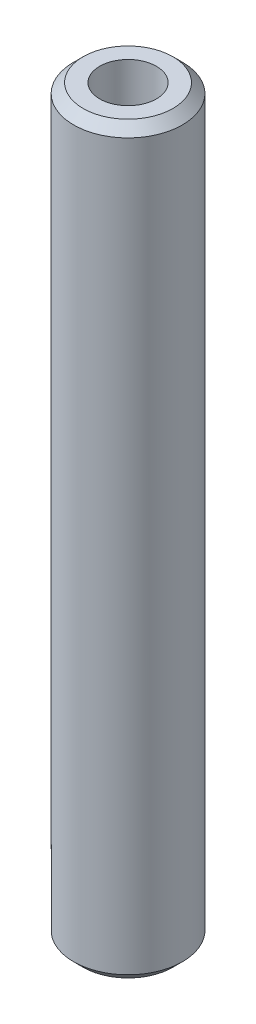
ISO-10303-21;
HEADER;
FILE_DESCRIPTION(('STEP AP214'),'2;1');
FILE_NAME('part.step','',(''),(''),'','','');
FILE_SCHEMA(('AUTOMOTIVE_DESIGN { 1 0 10303 214 1 1 1 1 }'));
ENDSEC;
DATA;
#1=APPLICATION_CONTEXT('core data for automotive mechanical design processes');
#2=APPLICATION_PROTOCOL_DEFINITION('international standard','automotive_design',2000,#1);
#3=PRODUCT_CONTEXT('',#1,'mechanical');
#4=PRODUCT('Part','Part','',(#3));
#5=PRODUCT_RELATED_PRODUCT_CATEGORY('part','',(#4));
#6=PRODUCT_DEFINITION_FORMATION('','',#4);
#7=PRODUCT_DEFINITION_CONTEXT('part definition',#1,'design');
#8=PRODUCT_DEFINITION('design','',#6,#7);
#9=PRODUCT_DEFINITION_SHAPE('','',#8);
#10=(LENGTH_UNIT() NAMED_UNIT(*) SI_UNIT(.MILLI.,.METRE.));
#11=(NAMED_UNIT(*) PLANE_ANGLE_UNIT() SI_UNIT($,.RADIAN.));
#12=(NAMED_UNIT(*) SI_UNIT($,.STERADIAN.) SOLID_ANGLE_UNIT());
#13=UNCERTAINTY_MEASURE_WITH_UNIT(LENGTH_MEASURE(1.E-05),#10,'distance_accuracy_value','');
#14=(GEOMETRIC_REPRESENTATION_CONTEXT(3) GLOBAL_UNCERTAINTY_ASSIGNED_CONTEXT((#13)) GLOBAL_UNIT_ASSIGNED_CONTEXT((#10,
#11,#12)) REPRESENTATION_CONTEXT('',''));
#15=CARTESIAN_POINT('',(0.,0.,0.));
#16=DIRECTION('',(0.,0.,1.));
#17=DIRECTION('',(1.,0.,0.));
#18=AXIS2_PLACEMENT_3D('',#15,#16,#17);
#19=CARTESIAN_POINT('',(0.,205.13082230466,0.));
#20=DIRECTION('',(0.,-1.,0.));
#21=DIRECTION('',(0.,0.,-1.));
#22=AXIS2_PLACEMENT_3D('',#19,#20,#21);
#23=CYLINDRICAL_SURFACE('',#22,15.);
#24=CARTESIAN_POINT('',(0.,202.50995726954,0.));
#25=DIRECTION('',(0.,1.,0.));
#26=DIRECTION('',(0.,0.,1.));
#27=AXIS2_PLACEMENT_3D('',#24,#25,#26);
#28=CIRCLE('',#27,15.);
#29=CARTESIAN_POINT('',(0.,202.50995726954,-15.));
#30=VERTEX_POINT('',#29);
#31=EDGE_CURVE('E50',#30,#30,#28,.F.);
#32=CARTESIAN_POINT('',(0.,2.62086503512082,0.));
#33=DIRECTION('',(0.,1.,0.));
#34=DIRECTION('',(0.,0.,1.));
#35=AXIS2_PLACEMENT_3D('',#32,#33,#34);
#36=CIRCLE('',#35,15.);
#37=CARTESIAN_POINT('',(0.,2.6208650351208,-15.));
#38=VERTEX_POINT('',#37);
#39=EDGE_CURVE('E51',#38,#38,#36,.T.);
#40=CARTESIAN_POINT('',(0.,202.50995726954,-15.));
#41=CARTESIAN_POINT('',(0.,200.427779225431,-15.));
#42=CARTESIAN_POINT('',(0.,198.345601181323,-15.));
#43=CARTESIAN_POINT('',(0.,194.181245093106,-15.));
#44=CARTESIAN_POINT('',(0.,192.099067048997,-15.));
#45=CARTESIAN_POINT('',(0.,187.93471096078,-15.));
#46=CARTESIAN_POINT('',(0.,185.852532916672,-15.));
#47=CARTESIAN_POINT('',(0.,181.688176828454,-15.));
#48=CARTESIAN_POINT('',(0.,179.605998784346,-15.));
#49=CARTESIAN_POINT('',(0.,175.441642696129,-15.));
#50=CARTESIAN_POINT('',(0.,173.35946465202,-15.));
#51=CARTESIAN_POINT('',(0.,169.195108563803,-15.));
#52=CARTESIAN_POINT('',(0.,167.112930519695,-15.));
#53=CARTESIAN_POINT('',(0.,162.948574431478,-15.));
#54=CARTESIAN_POINT('',(0.,160.866396387369,-15.));
#55=CARTESIAN_POINT('',(0.,156.702040299152,-15.));
#56=CARTESIAN_POINT('',(0.,154.619862255044,-15.));
#57=CARTESIAN_POINT('',(0.,150.455506166826,-15.));
#58=CARTESIAN_POINT('',(0.,148.373328122718,-15.));
#59=CARTESIAN_POINT('',(0.,144.208972034501,-15.));
#60=CARTESIAN_POINT('',(0.,142.126793990392,-15.));
#61=CARTESIAN_POINT('',(0.,137.962437902175,-15.));
#62=CARTESIAN_POINT('',(0.,135.880259858067,-15.));
#63=CARTESIAN_POINT('',(0.,131.71590376985,-15.));
#64=CARTESIAN_POINT('',(0.,129.633725725741,-15.));
#65=CARTESIAN_POINT('',(0.,125.469369637524,-15.));
#66=CARTESIAN_POINT('',(0.,123.387191593416,-15.));
#67=CARTESIAN_POINT('',(0.,119.222835505199,-15.));
#68=CARTESIAN_POINT('',(0.,117.14065746109,-15.));
#69=CARTESIAN_POINT('',(0.,112.976301372873,-15.));
#70=CARTESIAN_POINT('',(0.,110.894123328764,-15.));
#71=CARTESIAN_POINT('',(0.,106.729767240547,-15.));
#72=CARTESIAN_POINT('',(0.,104.647589196439,-15.));
#73=CARTESIAN_POINT('',(0.,100.483233108222,-15.));
#74=CARTESIAN_POINT('',(0.,98.4010550641132,-15.));
#75=CARTESIAN_POINT('',(0.,94.2366989758962,-15.));
#76=CARTESIAN_POINT('',(0.,92.1545209317876,-15.));
#77=CARTESIAN_POINT('',(0.,87.9901648435706,-15.));
#78=CARTESIAN_POINT('',(0.,85.907986799462,-15.));
#79=CARTESIAN_POINT('',(0.,81.743630711245,-15.));
#80=CARTESIAN_POINT('',(0.,79.6614526671364,-15.));
#81=CARTESIAN_POINT('',(0.,75.4970965789194,-15.));
#82=CARTESIAN_POINT('',(0.,73.4149185348109,-15.));
#83=CARTESIAN_POINT('',(0.,69.2505624465938,-15.));
#84=CARTESIAN_POINT('',(0.,67.1683844024853,-15.));
#85=CARTESIAN_POINT('',(0.,63.0040283142682,-15.));
#86=CARTESIAN_POINT('',(0.,60.9218502701597,-15.));
#87=CARTESIAN_POINT('',(0.,56.7574941819426,-15.));
#88=CARTESIAN_POINT('',(0.,54.6753161378341,-15.));
#89=CARTESIAN_POINT('',(0.,50.510960049617,-15.));
#90=CARTESIAN_POINT('',(0.,48.4287820055085,-15.));
#91=CARTESIAN_POINT('',(0.,44.2644259172914,-15.));
#92=CARTESIAN_POINT('',(0.,42.1822478731829,-15.));
#93=CARTESIAN_POINT('',(0.,38.0178917849658,-15.));
#94=CARTESIAN_POINT('',(0.,35.9357137408573,-15.));
#95=CARTESIAN_POINT('',(0.,31.7713576526402,-15.));
#96=CARTESIAN_POINT('',(0.,29.6891796085317,-15.));
#97=CARTESIAN_POINT('',(0.,25.5248235203146,-15.));
#98=CARTESIAN_POINT('',(0.,23.4426454762061,-15.));
#99=CARTESIAN_POINT('',(0.,19.2782893879891,-15.));
#100=CARTESIAN_POINT('',(0.,17.1961113438805,-15.));
#101=CARTESIAN_POINT('',(0.,13.0317552556635,-15.));
#102=CARTESIAN_POINT('',(0.,10.9495772115549,-15.));
#103=CARTESIAN_POINT('',(0.,6.78522112333788,-15.));
#104=CARTESIAN_POINT('',(0.,4.70304307922934,-15.));
#105=CARTESIAN_POINT('',(0.,2.6208650351208,-15.));
#106=B_SPLINE_CURVE_WITH_KNOTS('',3,(#40,#41,#42,#43,#44,#45,#46,#47,#48,#49,#50,#51,#52,#53,
#54,#55,#56,#57,#58,#59,#60,#61,#62,#63,#64,#65,#66,#67,#68,#69,#70,#71,#72,#73,#74,#75,#76,#77,
#78,#79,#80,#81,#82,#83,#84,#85,#86,#87,#88,#89,#90,#91,#92,#93,#94,#95,#96,#97,#98,#99,#100,
#101,#102,#103,#104,#105),.UNSPECIFIED.,.F.,.F.,(4,2,2,2,2,2,2,2,2,2,2,2,2,2,2,2,2,2,2,2,2,2,2,
2,2,2,2,2,2,2,2,2,4),(0.,6.24653413232559,12.4930682646512,18.7396023969768,24.9861365293024,
31.232670661628,37.4792047939536,43.7257389262791,49.9722730586047,56.2188071909303,
62.4653413232559,68.7118754555815,74.9584095879071,81.2049437202327,87.4514778525583,
93.6980119848839,99.9445461172095,106.191080249535,112.437614381861,118.684148514186,
124.930682646512,131.177216778837,137.423750911163,143.670285043489,149.916819175814,
156.16335330814,162.409887440465,168.656421572791,174.902955705117,181.149489837442,
187.396023969768,193.642558102093,199.889092234419),.UNSPECIFIED.);
#107=EDGE_CURVE('BSEAM39',#30,#38,#106,.T.);
#108=ORIENTED_EDGE('',*,*,#31,.T.);
#109=ORIENTED_EDGE('',*,*,#39,.T.);
#110=ORIENTED_EDGE('',*,*,#107,.T.);
#111=ORIENTED_EDGE('',*,*,#107,.F.);
#112=EDGE_LOOP('',(#108,#110,#109,#111));
#113=FACE_BOUND('',#112,.T.);
#114=ADVANCED_FACE('F39',(#113),#23,.T.);
#115=CARTESIAN_POINT('',(0.,205.13082230466,0.));
#116=DIRECTION('',(0.,1.,0.));
#117=DIRECTION('',(0.,0.,1.));
#118=AXIS2_PLACEMENT_3D('',#115,#116,#117);
#119=PLANE('',#118);
#120=CARTESIAN_POINT('',(0.,205.13082230466,0.));
#121=DIRECTION('',(0.,1.,0.));
#122=DIRECTION('',(0.,0.,1.));
#123=AXIS2_PLACEMENT_3D('',#120,#121,#122);
#124=CIRCLE('',#123,12.3791349648794);
#125=CARTESIAN_POINT('',(0.,205.13082230466,12.3791349648794));
#126=VERTEX_POINT('',#125);
#127=EDGE_CURVE('E54',#126,#126,#124,.T.);
#128=ORIENTED_EDGE('',*,*,#127,.T.);
#129=EDGE_LOOP('',(#128));
#130=FACE_BOUND('',#129,.T.);
#131=CARTESIAN_POINT('',(0.,205.13082230466,0.));
#132=DIRECTION('',(0.,1.,0.));
#133=DIRECTION('',(0.,0.,1.));
#134=AXIS2_PLACEMENT_3D('',#131,#132,#133);
#135=CIRCLE('',#134,7.8181317821136);
#136=CARTESIAN_POINT('',(0.,205.13082230466,-7.8181317821136));
#137=VERTEX_POINT('',#136);
#138=EDGE_CURVE('E58',#137,#137,#135,.T.);
#139=ORIENTED_EDGE('',*,*,#138,.F.);
#140=EDGE_LOOP('',(#139));
#141=FACE_BOUND('',#140,.T.);
#142=ADVANCED_FACE('F69',(#130,#141),#119,.T.);
#143=CARTESIAN_POINT('',(0.,0.,0.));
#144=DIRECTION('',(0.,1.,0.));
#145=DIRECTION('',(0.,0.,1.));
#146=AXIS2_PLACEMENT_3D('',#143,#144,#145);
#147=PLANE('',#146);
#148=CARTESIAN_POINT('',(0.,0.,0.));
#149=DIRECTION('',(0.,1.,0.));
#150=DIRECTION('',(0.,0.,1.));
#151=AXIS2_PLACEMENT_3D('',#148,#149,#150);
#152=CIRCLE('',#151,12.3791349648792);
#153=CARTESIAN_POINT('',(0.,0.,12.3791349648792));
#154=VERTEX_POINT('',#153);
#155=EDGE_CURVE('E10',#154,#154,#152,.F.);
#156=ORIENTED_EDGE('',*,*,#155,.T.);
#157=EDGE_LOOP('',(#156));
#158=FACE_BOUND('',#157,.T.);
#159=CARTESIAN_POINT('',(0.,0.,0.));
#160=DIRECTION('',(0.,1.,0.));
#161=DIRECTION('',(0.,0.,1.));
#162=AXIS2_PLACEMENT_3D('',#159,#160,#161);
#163=CIRCLE('',#162,7.8181317821136);
#164=CARTESIAN_POINT('',(0.,0.,-7.8181317821136));
#165=VERTEX_POINT('',#164);
#166=EDGE_CURVE('E63',#165,#165,#163,.T.);
#167=ORIENTED_EDGE('',*,*,#166,.T.);
#168=EDGE_LOOP('',(#167));
#169=FACE_BOUND('',#168,.T.);
#170=ADVANCED_FACE('F75',(#158,#169),#147,.F.);
#171=CARTESIAN_POINT('',(0.,205.13082230466,0.));
#172=DIRECTION('',(0.,-1.,0.));
#173=DIRECTION('',(0.,0.,-1.));
#174=AXIS2_PLACEMENT_3D('',#171,#172,#173);
#175=CYLINDRICAL_SURFACE('',#174,7.8181317821136);
#176=CARTESIAN_POINT('',(0.,205.13082230466,-7.8181317821136));
#177=CARTESIAN_POINT('',(0.,202.994042905653,-7.8181317821136));
#178=CARTESIAN_POINT('',(0.,200.857263506647,-7.8181317821136));
#179=CARTESIAN_POINT('',(0.,196.583704708633,-7.8181317821136));
#180=CARTESIAN_POINT('',(0.,194.446925309626,-7.8181317821136));
#181=CARTESIAN_POINT('',(0.,190.173366511612,-7.8181317821136));
#182=CARTESIAN_POINT('',(0.,188.036587112605,-7.8181317821136));
#183=CARTESIAN_POINT('',(0.,183.763028314592,-7.8181317821136));
#184=CARTESIAN_POINT('',(0.,181.626248915585,-7.8181317821136));
#185=CARTESIAN_POINT('',(0.,177.352690117571,-7.8181317821136));
#186=CARTESIAN_POINT('',(0.,175.215910718564,-7.8181317821136));
#187=CARTESIAN_POINT('',(0.,170.94235192055,-7.8181317821136));
#188=CARTESIAN_POINT('',(0.,168.805572521543,-7.8181317821136));
#189=CARTESIAN_POINT('',(0.,164.53201372353,-7.8181317821136));
#190=CARTESIAN_POINT('',(0.,162.395234324523,-7.8181317821136));
#191=CARTESIAN_POINT('',(0.,158.121675526509,-7.8181317821136));
#192=CARTESIAN_POINT('',(0.,155.984896127502,-7.8181317821136));
#193=CARTESIAN_POINT('',(0.,151.711337329488,-7.8181317821136));
#194=CARTESIAN_POINT('',(0.,149.574557930481,-7.8181317821136));
#195=CARTESIAN_POINT('',(0.,145.300999132468,-7.8181317821136));
#196=CARTESIAN_POINT('',(0.,143.164219733461,-7.8181317821136));
#197=CARTESIAN_POINT('',(0.,138.890660935447,-7.8181317821136));
#198=CARTESIAN_POINT('',(0.,136.75388153644,-7.8181317821136));
#199=CARTESIAN_POINT('',(0.,132.480322738426,-7.8181317821136));
#200=CARTESIAN_POINT('',(0.,130.34354333942,-7.8181317821136));
#201=CARTESIAN_POINT('',(0.,126.069984541406,-7.8181317821136));
#202=CARTESIAN_POINT('',(0.,123.933205142399,-7.8181317821136));
#203=CARTESIAN_POINT('',(0.,119.659646344385,-7.8181317821136));
#204=CARTESIAN_POINT('',(0.,117.522866945378,-7.8181317821136));
#205=CARTESIAN_POINT('',(0.,113.249308147365,-7.8181317821136));
#206=CARTESIAN_POINT('',(0.,111.112528748358,-7.8181317821136));
#207=CARTESIAN_POINT('',(0.,106.838969950344,-7.8181317821136));
#208=CARTESIAN_POINT('',(0.,104.702190551337,-7.8181317821136));
#209=CARTESIAN_POINT('',(0.,100.428631753323,-7.8181317821136));
#210=CARTESIAN_POINT('',(0.,98.2918523543164,-7.8181317821136));
#211=CARTESIAN_POINT('',(0.,94.0182935563026,-7.8181317821136));
#212=CARTESIAN_POINT('',(0.,91.8815141572957,-7.8181317821136));
#213=CARTESIAN_POINT('',(0.,87.607955359282,-7.8181317821136));
#214=CARTESIAN_POINT('',(0.,85.4711759602751,-7.8181317821136));
#215=CARTESIAN_POINT('',(0.,81.1976171622614,-7.8181317821136));
#216=CARTESIAN_POINT('',(0.,79.0608377632545,-7.8181317821136));
#217=CARTESIAN_POINT('',(0.,74.7872789652407,-7.8181317821136));
#218=CARTESIAN_POINT('',(0.,72.6504995662339,-7.8181317821136));
#219=CARTESIAN_POINT('',(0.,68.3769407682201,-7.8181317821136));
#220=CARTESIAN_POINT('',(0.,66.2401613692132,-7.8181317821136));
#221=CARTESIAN_POINT('',(0.,61.9666025711995,-7.8181317821136));
#222=CARTESIAN_POINT('',(0.,59.8298231721926,-7.8181317821136));
#223=CARTESIAN_POINT('',(0.,55.5562643741788,-7.8181317821136));
#224=CARTESIAN_POINT('',(0.,53.419484975172,-7.8181317821136));
#225=CARTESIAN_POINT('',(0.,49.1459261771582,-7.8181317821136));
#226=CARTESIAN_POINT('',(0.,47.0091467781513,-7.8181317821136));
#227=CARTESIAN_POINT('',(0.,42.7355879801376,-7.8181317821136));
#228=CARTESIAN_POINT('',(0.,40.5988085811307,-7.8181317821136));
#229=CARTESIAN_POINT('',(0.,36.3252497831169,-7.8181317821136));
#230=CARTESIAN_POINT('',(0.,34.18847038411,-7.8181317821136));
#231=CARTESIAN_POINT('',(0.,29.9149115860963,-7.8181317821136));
#232=CARTESIAN_POINT('',(0.,27.7781321870894,-7.8181317821136));
#233=CARTESIAN_POINT('',(0.,23.5045733890756,-7.8181317821136));
#234=CARTESIAN_POINT('',(0.,21.3677939900688,-7.8181317821136));
#235=CARTESIAN_POINT('',(0.,17.094235192055,-7.8181317821136));
#236=CARTESIAN_POINT('',(0.,14.9574557930481,-7.8181317821136));
#237=CARTESIAN_POINT('',(0.,10.6838969950344,-7.8181317821136));
#238=CARTESIAN_POINT('',(0.,8.54711759602749,-7.8181317821136));
#239=CARTESIAN_POINT('',(0.,4.27355879801373,-7.8181317821136));
#240=CARTESIAN_POINT('',(0.,2.13677939900686,-7.8181317821136));
#241=CARTESIAN_POINT('',(0.,0.,-7.8181317821136));
#242=B_SPLINE_CURVE_WITH_KNOTS('',3,(#176,#177,#178,#179,#180,#181,#182,#183,#184,#185,#186,
#187,#188,#189,#190,#191,#192,#193,#194,#195,#196,#197,#198,#199,#200,#201,#202,#203,#204,#205,
#206,#207,#208,#209,#210,#211,#212,#213,#214,#215,#216,#217,#218,#219,#220,#221,#222,#223,#224,
#225,#226,#227,#228,#229,#230,#231,#232,#233,#234,#235,#236,#237,#238,#239,#240,#241),
.UNSPECIFIED.,.F.,.F.,(4,2,2,2,2,2,2,2,2,2,2,2,2,2,2,2,2,2,2,2,2,2,2,2,2,2,2,2,2,2,2,2,4),(0.,
6.41033819702064,12.8206763940413,19.2310145910619,25.6413527880825,32.0516909851032,
38.4620291821238,44.8723673791445,51.2827055761651,57.6930437731857,64.1033819702064,
70.513720167227,76.9240583642477,83.3343965612683,89.7447347582889,96.1550729553096,
102.56541115233,108.975749349351,115.386087546371,121.796425743392,128.206763940413,
134.617102137433,141.027440334454,147.437778531475,153.848116728495,160.258454925516,
166.668793122537,173.079131319557,179.489469516578,185.899807713598,192.310145910619,
198.72048410764,205.13082230466),.UNSPECIFIED.);
#243=EDGE_CURVE('BSEAM70',#137,#165,#242,.T.);
#244=ORIENTED_EDGE('',*,*,#138,.T.);
#245=ORIENTED_EDGE('',*,*,#166,.F.);
#246=ORIENTED_EDGE('',*,*,#243,.T.);
#247=ORIENTED_EDGE('',*,*,#243,.F.);
#248=EDGE_LOOP('',(#244,#246,#245,#247));
#249=FACE_BOUND('',#248,.T.);
#250=ADVANCED_FACE('F70',(#249),#175,.F.);
#251=CARTESIAN_POINT('',(0.,205.13082230466,0.));
#252=DIRECTION('',(0.,-1.,0.));
#253=DIRECTION('',(0.,0.,-1.));
#254=AXIS2_PLACEMENT_3D('',#251,#252,#253);
#255=CONICAL_SURFACE('',#254,12.3791349648794,0.785398163397446);
#256=ORIENTED_EDGE('',*,*,#31,.F.);
#257=EDGE_LOOP('',(#256));
#258=FACE_BOUND('',#257,.T.);
#259=ORIENTED_EDGE('',*,*,#127,.F.);
#260=EDGE_LOOP('',(#259));
#261=FACE_BOUND('',#260,.T.);
#262=ADVANCED_FACE('F81',(#258,#261),#255,.T.);
#263=CARTESIAN_POINT('',(0.,2.62086503512082,0.));
#264=DIRECTION('',(0.,1.,0.));
#265=DIRECTION('',(0.,0.,1.));
#266=AXIS2_PLACEMENT_3D('',#263,#264,#265);
#267=CONICAL_SURFACE('',#266,15.,0.785398163397452);
#268=ORIENTED_EDGE('',*,*,#155,.F.);
#269=EDGE_LOOP('',(#268));
#270=FACE_BOUND('',#269,.T.);
#271=ORIENTED_EDGE('',*,*,#39,.F.);
#272=EDGE_LOOP('',(#271));
#273=FACE_BOUND('',#272,.T.);
#274=ADVANCED_FACE('F45',(#270,#273),#267,.T.);
#275=CLOSED_SHELL('',(#114,#142,#170,#250,#262,#274));
#276=MANIFOLD_SOLID_BREP('B2',#275);
#277=ADVANCED_BREP_SHAPE_REPRESENTATION('',(#18,#276),#14);
#278=SHAPE_DEFINITION_REPRESENTATION(#9,#277);
ENDSEC;
END-ISO-10303-21;
